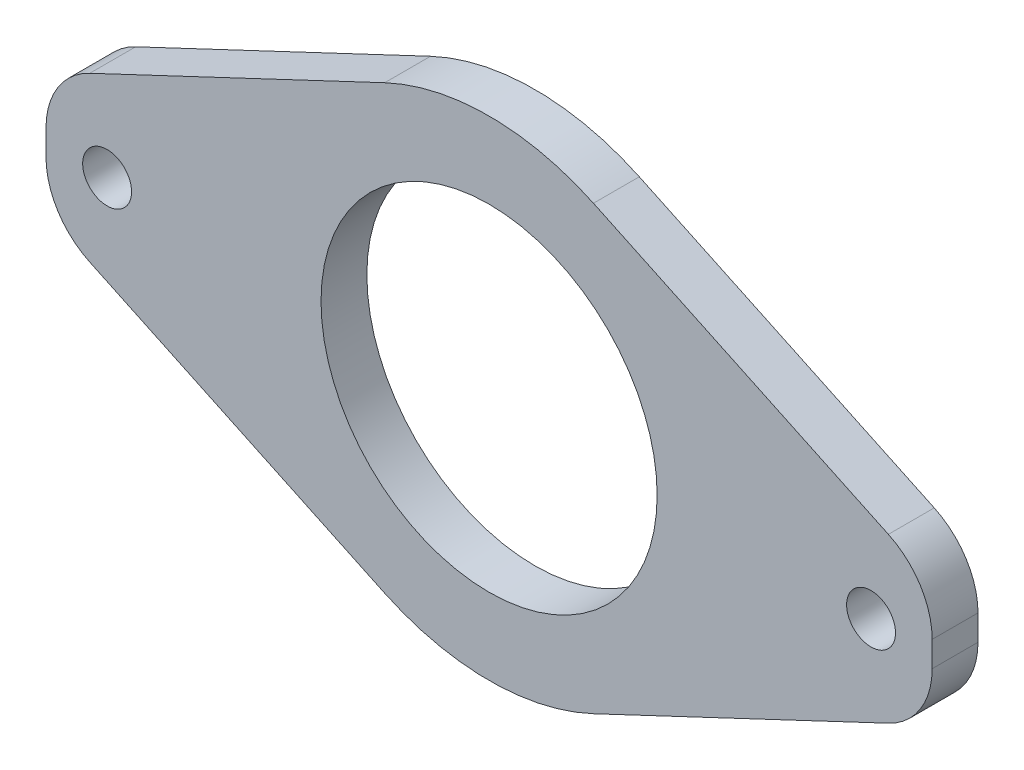
ISO-10303-21;
HEADER;
FILE_DESCRIPTION(('STEP AP214'),'2;1');
FILE_NAME('part.step','',(''),(''),'','','');
FILE_SCHEMA(('AUTOMOTIVE_DESIGN { 1 0 10303 214 1 1 1 1 }'));
ENDSEC;
DATA;
#1=APPLICATION_CONTEXT('core data for automotive mechanical design processes');
#2=APPLICATION_PROTOCOL_DEFINITION('international standard','automotive_design',2000,#1);
#3=PRODUCT_CONTEXT('',#1,'mechanical');
#4=PRODUCT('Part','Part','',(#3));
#5=PRODUCT_RELATED_PRODUCT_CATEGORY('part','',(#4));
#6=PRODUCT_DEFINITION_FORMATION('','',#4);
#7=PRODUCT_DEFINITION_CONTEXT('part definition',#1,'design');
#8=PRODUCT_DEFINITION('design','',#6,#7);
#9=PRODUCT_DEFINITION_SHAPE('','',#8);
#10=(LENGTH_UNIT() NAMED_UNIT(*) SI_UNIT(.MILLI.,.METRE.));
#11=(NAMED_UNIT(*) PLANE_ANGLE_UNIT() SI_UNIT($,.RADIAN.));
#12=(NAMED_UNIT(*) SI_UNIT($,.STERADIAN.) SOLID_ANGLE_UNIT());
#13=UNCERTAINTY_MEASURE_WITH_UNIT(LENGTH_MEASURE(1.E-05),#10,'distance_accuracy_value','');
#14=(GEOMETRIC_REPRESENTATION_CONTEXT(3) GLOBAL_UNCERTAINTY_ASSIGNED_CONTEXT((#13)) GLOBAL_UNIT_ASSIGNED_CONTEXT((#10,
#11,#12)) REPRESENTATION_CONTEXT('',''));
#15=CARTESIAN_POINT('',(0.,0.,0.));
#16=DIRECTION('',(0.,0.,1.));
#17=DIRECTION('',(1.,0.,0.));
#18=AXIS2_PLACEMENT_3D('',#15,#16,#17);
#19=CARTESIAN_POINT('',(0.,0.,3.));
#20=DIRECTION('',(0.,0.,-1.));
#21=DIRECTION('',(-1.,0.,0.));
#22=AXIS2_PLACEMENT_3D('',#19,#20,#21);
#23=CYLINDRICAL_SURFACE('',#22,16.);
#24=CARTESIAN_POINT('',(0.,0.,0.));
#25=DIRECTION('',(0.,0.,1.));
#26=DIRECTION('',(1.,0.,0.));
#27=AXIS2_PLACEMENT_3D('',#24,#25,#26);
#28=CIRCLE('',#27,16.);
#29=CARTESIAN_POINT('',(-6.83199616565601,14.4680277989939,0.));
#30=VERTEX_POINT('',#29);
#31=CARTESIAN_POINT('',(6.83199616565601,14.4680277989939,0.));
#32=VERTEX_POINT('',#31);
#33=EDGE_CURVE('E147',#30,#32,#28,.F.);
#34=ORIENTED_EDGE('',*,*,#33,.F.);
#35=DIRECTION('',(0.,0.,-1.));
#36=VECTOR('',#35,1.);
#37=CARTESIAN_POINT('',(-6.83199616565601,14.4680277989939,3.));
#38=LINE('',#37,#36);
#39=CARTESIAN_POINT('',(-6.83199616565601,14.4680277989939,3.));
#40=VERTEX_POINT('',#39);
#41=EDGE_CURVE('E135',#40,#30,#38,.T.);
#42=ORIENTED_EDGE('',*,*,#41,.F.);
#43=CARTESIAN_POINT('',(0.,0.,3.));
#44=DIRECTION('',(0.,0.,1.));
#45=DIRECTION('',(1.,0.,0.));
#46=AXIS2_PLACEMENT_3D('',#43,#44,#45);
#47=CIRCLE('',#46,16.);
#48=CARTESIAN_POINT('',(6.83199616565601,14.4680277989939,3.));
#49=VERTEX_POINT('',#48);
#50=EDGE_CURVE('E141',#40,#49,#47,.F.);
#51=ORIENTED_EDGE('',*,*,#50,.T.);
#52=DIRECTION('',(0.,0.,-1.));
#53=VECTOR('',#52,1.);
#54=CARTESIAN_POINT('',(6.83199616565601,14.4680277989939,3.));
#55=LINE('',#54,#53);
#56=EDGE_CURVE('E185',#49,#32,#55,.T.);
#57=ORIENTED_EDGE('',*,*,#56,.T.);
#58=EDGE_LOOP('',(#34,#42,#51,#57));
#59=FACE_BOUND('',#58,.T.);
#60=ADVANCED_FACE('F40',(#59),#23,.T.);
#61=CARTESIAN_POINT('',(-6.831996165656,14.4680277989939,3.));
#62=DIRECTION('',(-0.4269997603535,0.904251737437122,0.));
#63=DIRECTION('',(-0.904251737437122,-0.4269997603535,0.));
#64=AXIS2_PLACEMENT_3D('',#61,#62,#63);
#65=PLANE('',#64);
#66=DIRECTION('',(0.904251737437122,0.4269997603535,0.));
#67=VECTOR('',#66,1.);
#68=CARTESIAN_POINT('',(-6.831996165656,14.4680277989939,0.));
#69=LINE('',#68,#67);
#70=CARTESIAN_POINT('',(-26.1349988017675,5.35289187115644,0.));
#71=VERTEX_POINT('',#70);
#72=EDGE_CURVE('E188',#71,#30,#69,.T.);
#73=ORIENTED_EDGE('',*,*,#72,.F.);
#74=DIRECTION('',(0.,0.,-1.));
#75=VECTOR('',#74,1.);
#76=CARTESIAN_POINT('',(-26.1349988017675,5.35289187115644,3.));
#77=LINE('',#76,#75);
#78=CARTESIAN_POINT('',(-26.1349988017675,5.35289187115644,3.));
#79=VERTEX_POINT('',#78);
#80=EDGE_CURVE('E48',#71,#79,#77,.F.);
#81=ORIENTED_EDGE('',*,*,#80,.T.);
#82=DIRECTION('',(0.904251737437122,0.4269997603535,0.));
#83=VECTOR('',#82,1.);
#84=CARTESIAN_POINT('',(-6.831996165656,14.4680277989939,3.));
#85=LINE('',#84,#83);
#86=EDGE_CURVE('E131',#79,#40,#85,.T.);
#87=ORIENTED_EDGE('',*,*,#86,.T.);
#88=ORIENTED_EDGE('',*,*,#41,.T.);
#89=EDGE_LOOP('',(#73,#81,#87,#88));
#90=FACE_BOUND('',#89,.T.);
#91=ADVANCED_FACE('F134',(#90),#65,.T.);
#92=CARTESIAN_POINT('',(-29.,0.,3.));
#93=DIRECTION('',(-1.,0.,0.));
#94=DIRECTION('',(0.,0.,1.));
#95=AXIS2_PLACEMENT_3D('',#92,#93,#94);
#96=PLANE('',#95);
#97=DIRECTION('',(0.,1.,0.));
#98=VECTOR('',#97,1.);
#99=CARTESIAN_POINT('',(-29.,0.,3.));
#100=LINE('',#99,#98);
#101=CARTESIAN_POINT('',(-29.,-0.831633183970835,3.));
#102=VERTEX_POINT('',#101);
#103=CARTESIAN_POINT('',(-29.,0.831633183970836,3.));
#104=VERTEX_POINT('',#103);
#105=EDGE_CURVE('E140',#102,#104,#100,.T.);
#106=ORIENTED_EDGE('',*,*,#105,.T.);
#107=DIRECTION('',(0.,0.,-1.));
#108=VECTOR('',#107,1.);
#109=CARTESIAN_POINT('',(-29.,0.831633183970836,3.));
#110=LINE('',#109,#108);
#111=CARTESIAN_POINT('',(-29.,0.831633183970836,0.));
#112=VERTEX_POINT('',#111);
#113=EDGE_CURVE('E249',#104,#112,#110,.T.);
#114=ORIENTED_EDGE('',*,*,#113,.T.);
#115=DIRECTION('',(0.,1.,0.));
#116=VECTOR('',#115,1.);
#117=CARTESIAN_POINT('',(-29.,0.,0.));
#118=LINE('',#117,#116);
#119=CARTESIAN_POINT('',(-29.,-0.831633183970835,0.));
#120=VERTEX_POINT('',#119);
#121=EDGE_CURVE('E192',#120,#112,#118,.T.);
#122=ORIENTED_EDGE('',*,*,#121,.F.);
#123=DIRECTION('',(0.,0.,-1.));
#124=VECTOR('',#123,1.);
#125=CARTESIAN_POINT('',(-29.,-0.831633183970835,3.));
#126=LINE('',#125,#124);
#127=EDGE_CURVE('E247',#120,#102,#126,.F.);
#128=ORIENTED_EDGE('',*,*,#127,.T.);
#129=EDGE_LOOP('',(#106,#114,#122,#128));
#130=FACE_BOUND('',#129,.T.);
#131=ADVANCED_FACE('F255',(#130),#96,.T.);
#132=CARTESIAN_POINT('',(-6.831996165656,-14.4680277989939,3.));
#133=DIRECTION('',(0.4269997603535,0.904251737437122,0.));
#134=DIRECTION('',(-0.904251737437122,0.4269997603535,0.));
#135=AXIS2_PLACEMENT_3D('',#132,#133,#134);
#136=PLANE('',#135);
#137=DIRECTION('',(0.904251737437122,-0.4269997603535,0.));
#138=VECTOR('',#137,1.);
#139=CARTESIAN_POINT('',(-6.831996165656,-14.4680277989939,3.));
#140=LINE('',#139,#138);
#141=CARTESIAN_POINT('',(-26.1349988017675,-5.35289187115644,3.));
#142=VERTEX_POINT('',#141);
#143=CARTESIAN_POINT('',(-6.83199616565601,-14.4680277989939,3.));
#144=VERTEX_POINT('',#143);
#145=EDGE_CURVE('E165',#142,#144,#140,.T.);
#146=ORIENTED_EDGE('',*,*,#145,.F.);
#147=DIRECTION('',(0.,0.,-1.));
#148=VECTOR('',#147,1.);
#149=CARTESIAN_POINT('',(-26.1349988017675,-5.35289187115644,0.));
#150=LINE('',#149,#148);
#151=CARTESIAN_POINT('',(-26.1349988017675,-5.35289187115644,0.));
#152=VERTEX_POINT('',#151);
#153=EDGE_CURVE('E12',#142,#152,#150,.T.);
#154=ORIENTED_EDGE('',*,*,#153,.T.);
#155=DIRECTION('',(0.904251737437122,-0.4269997603535,0.));
#156=VECTOR('',#155,1.);
#157=CARTESIAN_POINT('',(-6.831996165656,-14.4680277989939,0.));
#158=LINE('',#157,#156);
#159=CARTESIAN_POINT('',(-6.83199616565601,-14.4680277989939,0.));
#160=VERTEX_POINT('',#159);
#161=EDGE_CURVE('E264',#152,#160,#158,.T.);
#162=ORIENTED_EDGE('',*,*,#161,.T.);
#163=DIRECTION('',(0.,0.,-1.));
#164=VECTOR('',#163,1.);
#165=CARTESIAN_POINT('',(-6.83199616565601,-14.4680277989939,3.));
#166=LINE('',#165,#164);
#167=EDGE_CURVE('E149',#144,#160,#166,.T.);
#168=ORIENTED_EDGE('',*,*,#167,.F.);
#169=EDGE_LOOP('',(#146,#154,#162,#168));
#170=FACE_BOUND('',#169,.T.);
#171=ADVANCED_FACE('F294',(#170),#136,.F.);
#172=CARTESIAN_POINT('',(0.,0.,3.));
#173=DIRECTION('',(0.,0.,-1.));
#174=DIRECTION('',(-1.,0.,0.));
#175=AXIS2_PLACEMENT_3D('',#172,#173,#174);
#176=CYLINDRICAL_SURFACE('',#175,16.);
#177=CARTESIAN_POINT('',(0.,0.,0.));
#178=DIRECTION('',(0.,0.,1.));
#179=DIRECTION('',(1.,0.,0.));
#180=AXIS2_PLACEMENT_3D('',#177,#178,#179);
#181=CIRCLE('',#180,16.);
#182=CARTESIAN_POINT('',(6.83199616565601,-14.4680277989939,0.));
#183=VERTEX_POINT('',#182);
#184=EDGE_CURVE('E266',#160,#183,#181,.T.);
#185=ORIENTED_EDGE('',*,*,#184,.T.);
#186=DIRECTION('',(0.,0.,-1.));
#187=VECTOR('',#186,1.);
#188=CARTESIAN_POINT('',(6.83199616565601,-14.4680277989939,3.));
#189=LINE('',#188,#187);
#190=CARTESIAN_POINT('',(6.83199616565601,-14.4680277989939,3.));
#191=VERTEX_POINT('',#190);
#192=EDGE_CURVE('E215',#191,#183,#189,.T.);
#193=ORIENTED_EDGE('',*,*,#192,.F.);
#194=CARTESIAN_POINT('',(0.,0.,3.));
#195=DIRECTION('',(0.,0.,1.));
#196=DIRECTION('',(1.,0.,0.));
#197=AXIS2_PLACEMENT_3D('',#194,#195,#196);
#198=CIRCLE('',#197,16.);
#199=EDGE_CURVE('E167',#144,#191,#198,.T.);
#200=ORIENTED_EDGE('',*,*,#199,.F.);
#201=ORIENTED_EDGE('',*,*,#167,.T.);
#202=EDGE_LOOP('',(#185,#193,#200,#201));
#203=FACE_BOUND('',#202,.T.);
#204=ADVANCED_FACE('F298',(#203),#176,.T.);
#205=CARTESIAN_POINT('',(6.831996165656,-14.4680277989939,3.));
#206=DIRECTION('',(0.4269997603535,-0.904251737437122,0.));
#207=DIRECTION('',(0.904251737437122,0.4269997603535,0.));
#208=AXIS2_PLACEMENT_3D('',#205,#206,#207);
#209=PLANE('',#208);
#210=DIRECTION('',(-0.904251737437122,-0.4269997603535,0.));
#211=VECTOR('',#210,1.);
#212=CARTESIAN_POINT('',(6.831996165656,-14.4680277989939,0.));
#213=LINE('',#212,#211);
#214=CARTESIAN_POINT('',(26.1349988017675,-5.35289187115644,0.));
#215=VERTEX_POINT('',#214);
#216=EDGE_CURVE('E271',#215,#183,#213,.T.);
#217=ORIENTED_EDGE('',*,*,#216,.F.);
#218=DIRECTION('',(0.,0.,-1.));
#219=VECTOR('',#218,1.);
#220=CARTESIAN_POINT('',(26.1349988017675,-5.35289187115644,3.));
#221=LINE('',#220,#219);
#222=CARTESIAN_POINT('',(26.1349988017675,-5.35289187115644,3.));
#223=VERTEX_POINT('',#222);
#224=EDGE_CURVE('E55',#215,#223,#221,.F.);
#225=ORIENTED_EDGE('',*,*,#224,.T.);
#226=DIRECTION('',(-0.904251737437122,-0.4269997603535,0.));
#227=VECTOR('',#226,1.);
#228=CARTESIAN_POINT('',(6.831996165656,-14.4680277989939,3.));
#229=LINE('',#228,#227);
#230=EDGE_CURVE('E170',#223,#191,#229,.T.);
#231=ORIENTED_EDGE('',*,*,#230,.T.);
#232=ORIENTED_EDGE('',*,*,#192,.T.);
#233=EDGE_LOOP('',(#217,#225,#231,#232));
#234=FACE_BOUND('',#233,.T.);
#235=ADVANCED_FACE('F331',(#234),#209,.T.);
#236=CARTESIAN_POINT('',(29.,0.,3.));
#237=DIRECTION('',(1.,0.,0.));
#238=DIRECTION('',(0.,0.,-1.));
#239=AXIS2_PLACEMENT_3D('',#236,#237,#238);
#240=PLANE('',#239);
#241=DIRECTION('',(0.,-1.,0.));
#242=VECTOR('',#241,1.);
#243=CARTESIAN_POINT('',(29.,0.,0.));
#244=LINE('',#243,#242);
#245=CARTESIAN_POINT('',(29.,0.831633183970835,0.));
#246=VERTEX_POINT('',#245);
#247=CARTESIAN_POINT('',(29.,-0.831633183970836,0.));
#248=VERTEX_POINT('',#247);
#249=EDGE_CURVE('E282',#246,#248,#244,.T.);
#250=ORIENTED_EDGE('',*,*,#249,.F.);
#251=DIRECTION('',(0.,0.,-1.));
#252=VECTOR('',#251,1.);
#253=CARTESIAN_POINT('',(29.,0.831633183970835,3.));
#254=LINE('',#253,#252);
#255=CARTESIAN_POINT('',(29.,0.831633183970835,3.));
#256=VERTEX_POINT('',#255);
#257=EDGE_CURVE('E237',#246,#256,#254,.F.);
#258=ORIENTED_EDGE('',*,*,#257,.T.);
#259=DIRECTION('',(0.,-1.,0.));
#260=VECTOR('',#259,1.);
#261=CARTESIAN_POINT('',(29.,0.,3.));
#262=LINE('',#261,#260);
#263=CARTESIAN_POINT('',(29.,-0.831633183970836,3.));
#264=VERTEX_POINT('',#263);
#265=EDGE_CURVE('E172',#256,#264,#262,.T.);
#266=ORIENTED_EDGE('',*,*,#265,.T.);
#267=DIRECTION('',(0.,0.,-1.));
#268=VECTOR('',#267,1.);
#269=CARTESIAN_POINT('',(29.,-0.831633183970836,3.));
#270=LINE('',#269,#268);
#271=EDGE_CURVE('E234',#264,#248,#270,.T.);
#272=ORIENTED_EDGE('',*,*,#271,.T.);
#273=EDGE_LOOP('',(#250,#258,#266,#272));
#274=FACE_BOUND('',#273,.T.);
#275=ADVANCED_FACE('F305',(#274),#240,.T.);
#276=CARTESIAN_POINT('',(-25.,0.,3.));
#277=DIRECTION('',(0.,0.,-1.));
#278=DIRECTION('',(-1.,0.,0.));
#279=AXIS2_PLACEMENT_3D('',#276,#277,#278);
#280=CYLINDRICAL_SURFACE('',#279,1.6);
#281=CARTESIAN_POINT('',(-25.,0.,3.));
#282=DIRECTION('',(0.,0.,1.));
#283=DIRECTION('',(1.,0.,0.));
#284=AXIS2_PLACEMENT_3D('',#281,#282,#283);
#285=CIRCLE('',#284,1.6);
#286=CARTESIAN_POINT('',(-23.4,0.,3.));
#287=VERTEX_POINT('',#286);
#288=EDGE_CURVE('E179',#287,#287,#285,.T.);
#289=ORIENTED_EDGE('',*,*,#288,.T.);
#290=EDGE_LOOP('',(#289));
#291=FACE_BOUND('',#290,.T.);
#292=CARTESIAN_POINT('',(-25.,0.,0.));
#293=DIRECTION('',(0.,0.,1.));
#294=DIRECTION('',(1.,0.,0.));
#295=AXIS2_PLACEMENT_3D('',#292,#293,#294);
#296=CIRCLE('',#295,1.6);
#297=CARTESIAN_POINT('',(-23.4,0.,0.));
#298=VERTEX_POINT('',#297);
#299=EDGE_CURVE('E161',#298,#298,#296,.T.);
#300=ORIENTED_EDGE('',*,*,#299,.F.);
#301=EDGE_LOOP('',(#300));
#302=FACE_BOUND('',#301,.T.);
#303=ADVANCED_FACE('F336',(#291,#302),#280,.F.);
#304=CARTESIAN_POINT('',(0.,0.,3.));
#305=DIRECTION('',(0.,0.,-1.));
#306=DIRECTION('',(-1.,0.,0.));
#307=AXIS2_PLACEMENT_3D('',#304,#305,#306);
#308=CYLINDRICAL_SURFACE('',#307,11.);
#309=CARTESIAN_POINT('',(0.,0.,3.));
#310=DIRECTION('',(0.,0.,1.));
#311=DIRECTION('',(1.,0.,0.));
#312=AXIS2_PLACEMENT_3D('',#309,#310,#311);
#313=CIRCLE('',#312,11.);
#314=CARTESIAN_POINT('',(11.,0.,3.));
#315=VERTEX_POINT('',#314);
#316=EDGE_CURVE('E176',#315,#315,#313,.T.);
#317=ORIENTED_EDGE('',*,*,#316,.T.);
#318=EDGE_LOOP('',(#317));
#319=FACE_BOUND('',#318,.T.);
#320=CARTESIAN_POINT('',(0.,0.,0.));
#321=DIRECTION('',(0.,0.,1.));
#322=DIRECTION('',(1.,0.,0.));
#323=AXIS2_PLACEMENT_3D('',#320,#321,#322);
#324=CIRCLE('',#323,11.);
#325=CARTESIAN_POINT('',(11.,0.,0.));
#326=VERTEX_POINT('',#325);
#327=EDGE_CURVE('E201',#326,#326,#324,.T.);
#328=ORIENTED_EDGE('',*,*,#327,.F.);
#329=EDGE_LOOP('',(#328));
#330=FACE_BOUND('',#329,.T.);
#331=ADVANCED_FACE('F340',(#319,#330),#308,.F.);
#332=CARTESIAN_POINT('',(6.831996165656,14.4680277989939,3.));
#333=DIRECTION('',(-0.4269997603535,-0.904251737437122,0.));
#334=DIRECTION('',(0.904251737437122,-0.4269997603535,0.));
#335=AXIS2_PLACEMENT_3D('',#332,#333,#334);
#336=PLANE('',#335);
#337=DIRECTION('',(-0.904251737437122,0.4269997603535,0.));
#338=VECTOR('',#337,1.);
#339=CARTESIAN_POINT('',(6.831996165656,14.4680277989939,3.));
#340=LINE('',#339,#338);
#341=CARTESIAN_POINT('',(26.1349988017675,5.35289187115644,3.));
#342=VERTEX_POINT('',#341);
#343=EDGE_CURVE('E155',#342,#49,#340,.T.);
#344=ORIENTED_EDGE('',*,*,#343,.F.);
#345=DIRECTION('',(0.,0.,-1.));
#346=VECTOR('',#345,1.);
#347=CARTESIAN_POINT('',(26.1349988017675,5.35289187115644,0.));
#348=LINE('',#347,#346);
#349=CARTESIAN_POINT('',(26.1349988017675,5.35289187115644,0.));
#350=VERTEX_POINT('',#349);
#351=EDGE_CURVE('E148',#342,#350,#348,.T.);
#352=ORIENTED_EDGE('',*,*,#351,.T.);
#353=DIRECTION('',(-0.904251737437122,0.4269997603535,0.));
#354=VECTOR('',#353,1.);
#355=CARTESIAN_POINT('',(6.831996165656,14.4680277989939,0.));
#356=LINE('',#355,#354);
#357=EDGE_CURVE('E206',#350,#32,#356,.T.);
#358=ORIENTED_EDGE('',*,*,#357,.T.);
#359=ORIENTED_EDGE('',*,*,#56,.F.);
#360=EDGE_LOOP('',(#344,#352,#358,#359));
#361=FACE_BOUND('',#360,.T.);
#362=ADVANCED_FACE('F289',(#361),#336,.F.);
#363=CARTESIAN_POINT('',(25.,0.,3.));
#364=DIRECTION('',(0.,0.,-1.));
#365=DIRECTION('',(-1.,0.,0.));
#366=AXIS2_PLACEMENT_3D('',#363,#364,#365);
#367=CYLINDRICAL_SURFACE('',#366,1.6);
#368=CARTESIAN_POINT('',(25.,0.,3.));
#369=DIRECTION('',(0.,0.,1.));
#370=DIRECTION('',(1.,0.,0.));
#371=AXIS2_PLACEMENT_3D('',#368,#369,#370);
#372=CIRCLE('',#371,1.6);
#373=CARTESIAN_POINT('',(26.6,0.,3.));
#374=VERTEX_POINT('',#373);
#375=EDGE_CURVE('E182',#374,#374,#372,.T.);
#376=ORIENTED_EDGE('',*,*,#375,.T.);
#377=EDGE_LOOP('',(#376));
#378=FACE_BOUND('',#377,.T.);
#379=CARTESIAN_POINT('',(25.,0.,0.));
#380=DIRECTION('',(0.,0.,1.));
#381=DIRECTION('',(1.,0.,0.));
#382=AXIS2_PLACEMENT_3D('',#379,#380,#381);
#383=CIRCLE('',#382,1.6);
#384=CARTESIAN_POINT('',(26.6,0.,0.));
#385=VERTEX_POINT('',#384);
#386=EDGE_CURVE('E157',#385,#385,#383,.T.);
#387=ORIENTED_EDGE('',*,*,#386,.F.);
#388=EDGE_LOOP('',(#387));
#389=FACE_BOUND('',#388,.T.);
#390=ADVANCED_FACE('F339',(#378,#389),#367,.F.);
#391=CARTESIAN_POINT('',(0.,0.,3.));
#392=DIRECTION('',(0.,0.,1.));
#393=DIRECTION('',(1.,0.,0.));
#394=AXIS2_PLACEMENT_3D('',#391,#392,#393);
#395=PLANE('',#394);
#396=ORIENTED_EDGE('',*,*,#265,.F.);
#397=CARTESIAN_POINT('',(24.,0.831633183970835,3.));
#398=DIRECTION('',(0.,0.,1.));
#399=DIRECTION('',(1.,0.,0.));
#400=AXIS2_PLACEMENT_3D('',#397,#398,#399);
#401=CIRCLE('',#400,5.);
#402=EDGE_CURVE('E244',#256,#342,#401,.T.);
#403=ORIENTED_EDGE('',*,*,#402,.T.);
#404=ORIENTED_EDGE('',*,*,#343,.T.);
#405=ORIENTED_EDGE('',*,*,#50,.F.);
#406=ORIENTED_EDGE('',*,*,#86,.F.);
#407=CARTESIAN_POINT('',(-24.,0.831633183970836,3.));
#408=DIRECTION('',(0.,0.,1.));
#409=DIRECTION('',(1.,0.,0.));
#410=AXIS2_PLACEMENT_3D('',#407,#408,#409);
#411=CIRCLE('',#410,5.);
#412=EDGE_CURVE('E240',#79,#104,#411,.T.);
#413=ORIENTED_EDGE('',*,*,#412,.T.);
#414=ORIENTED_EDGE('',*,*,#105,.F.);
#415=CARTESIAN_POINT('',(-24.,-0.831633183970835,3.));
#416=DIRECTION('',(0.,0.,1.));
#417=DIRECTION('',(1.,0.,0.));
#418=AXIS2_PLACEMENT_3D('',#415,#416,#417);
#419=CIRCLE('',#418,5.);
#420=EDGE_CURVE('E63',#102,#142,#419,.T.);
#421=ORIENTED_EDGE('',*,*,#420,.T.);
#422=ORIENTED_EDGE('',*,*,#145,.T.);
#423=ORIENTED_EDGE('',*,*,#199,.T.);
#424=ORIENTED_EDGE('',*,*,#230,.F.);
#425=CARTESIAN_POINT('',(24.,-0.831633183970836,3.));
#426=DIRECTION('',(0.,0.,1.));
#427=DIRECTION('',(1.,0.,0.));
#428=AXIS2_PLACEMENT_3D('',#425,#426,#427);
#429=CIRCLE('',#428,5.);
#430=EDGE_CURVE('E242',#223,#264,#429,.T.);
#431=ORIENTED_EDGE('',*,*,#430,.T.);
#432=EDGE_LOOP('',(#396,#403,#404,#405,#406,#413,#414,#421,#422,#423,#424,#431));
#433=FACE_BOUND('',#432,.T.);
#434=ORIENTED_EDGE('',*,*,#316,.F.);
#435=EDGE_LOOP('',(#434));
#436=FACE_BOUND('',#435,.T.);
#437=ORIENTED_EDGE('',*,*,#288,.F.);
#438=EDGE_LOOP('',(#437));
#439=FACE_BOUND('',#438,.T.);
#440=ORIENTED_EDGE('',*,*,#375,.F.);
#441=EDGE_LOOP('',(#440));
#442=FACE_BOUND('',#441,.T.);
#443=ADVANCED_FACE('F152',(#433,#436,#439,#442),#395,.T.);
#444=CARTESIAN_POINT('',(0.,0.,0.));
#445=DIRECTION('',(0.,0.,1.));
#446=DIRECTION('',(1.,0.,0.));
#447=AXIS2_PLACEMENT_3D('',#444,#445,#446);
#448=PLANE('',#447);
#449=ORIENTED_EDGE('',*,*,#357,.F.);
#450=CARTESIAN_POINT('',(24.,0.831633183970835,0.));
#451=DIRECTION('',(0.,0.,1.));
#452=DIRECTION('',(1.,0.,0.));
#453=AXIS2_PLACEMENT_3D('',#450,#451,#452);
#454=CIRCLE('',#453,5.);
#455=EDGE_CURVE('E231',#350,#246,#454,.F.);
#456=ORIENTED_EDGE('',*,*,#455,.T.);
#457=ORIENTED_EDGE('',*,*,#249,.T.);
#458=CARTESIAN_POINT('',(24.,-0.831633183970836,0.));
#459=DIRECTION('',(0.,0.,1.));
#460=DIRECTION('',(1.,0.,0.));
#461=AXIS2_PLACEMENT_3D('',#458,#459,#460);
#462=CIRCLE('',#461,5.);
#463=EDGE_CURVE('E228',#248,#215,#462,.F.);
#464=ORIENTED_EDGE('',*,*,#463,.T.);
#465=ORIENTED_EDGE('',*,*,#216,.T.);
#466=ORIENTED_EDGE('',*,*,#184,.F.);
#467=ORIENTED_EDGE('',*,*,#161,.F.);
#468=CARTESIAN_POINT('',(-24.,-0.831633183970835,0.));
#469=DIRECTION('',(0.,0.,1.));
#470=DIRECTION('',(1.,0.,0.));
#471=AXIS2_PLACEMENT_3D('',#468,#469,#470);
#472=CIRCLE('',#471,5.);
#473=EDGE_CURVE('E222',#152,#120,#472,.F.);
#474=ORIENTED_EDGE('',*,*,#473,.T.);
#475=ORIENTED_EDGE('',*,*,#121,.T.);
#476=CARTESIAN_POINT('',(-24.,0.831633183970836,0.));
#477=DIRECTION('',(0.,0.,1.));
#478=DIRECTION('',(1.,0.,0.));
#479=AXIS2_PLACEMENT_3D('',#476,#477,#478);
#480=CIRCLE('',#479,5.);
#481=EDGE_CURVE('E225',#112,#71,#480,.F.);
#482=ORIENTED_EDGE('',*,*,#481,.T.);
#483=ORIENTED_EDGE('',*,*,#72,.T.);
#484=ORIENTED_EDGE('',*,*,#33,.T.);
#485=EDGE_LOOP('',(#449,#456,#457,#464,#465,#466,#467,#474,#475,#482,#483,#484));
#486=FACE_BOUND('',#485,.T.);
#487=ORIENTED_EDGE('',*,*,#327,.T.);
#488=EDGE_LOOP('',(#487));
#489=FACE_BOUND('',#488,.T.);
#490=ORIENTED_EDGE('',*,*,#299,.T.);
#491=EDGE_LOOP('',(#490));
#492=FACE_BOUND('',#491,.T.);
#493=ORIENTED_EDGE('',*,*,#386,.T.);
#494=EDGE_LOOP('',(#493));
#495=FACE_BOUND('',#494,.T.);
#496=ADVANCED_FACE('F260',(#486,#489,#492,#495),#448,.F.);
#497=CARTESIAN_POINT('',(24.,0.831633183970835,3.));
#498=DIRECTION('',(0.,0.,1.));
#499=DIRECTION('',(1.,0.,0.));
#500=AXIS2_PLACEMENT_3D('',#497,#498,#499);
#501=CYLINDRICAL_SURFACE('',#500,5.);
#502=ORIENTED_EDGE('',*,*,#402,.F.);
#503=ORIENTED_EDGE('',*,*,#257,.F.);
#504=ORIENTED_EDGE('',*,*,#455,.F.);
#505=ORIENTED_EDGE('',*,*,#351,.F.);
#506=EDGE_LOOP('',(#502,#503,#504,#505));
#507=FACE_BOUND('',#506,.T.);
#508=ADVANCED_FACE('F309',(#507),#501,.T.);
#509=CARTESIAN_POINT('',(24.,-0.831633183970836,3.));
#510=DIRECTION('',(0.,0.,-1.));
#511=DIRECTION('',(-1.,0.,0.));
#512=AXIS2_PLACEMENT_3D('',#509,#510,#511);
#513=CYLINDRICAL_SURFACE('',#512,5.);
#514=ORIENTED_EDGE('',*,*,#430,.F.);
#515=ORIENTED_EDGE('',*,*,#224,.F.);
#516=ORIENTED_EDGE('',*,*,#463,.F.);
#517=ORIENTED_EDGE('',*,*,#271,.F.);
#518=EDGE_LOOP('',(#514,#515,#516,#517));
#519=FACE_BOUND('',#518,.T.);
#520=ADVANCED_FACE('F303',(#519),#513,.T.);
#521=CARTESIAN_POINT('',(-24.,0.831633183970836,3.));
#522=DIRECTION('',(0.,0.,-1.));
#523=DIRECTION('',(-1.,0.,0.));
#524=AXIS2_PLACEMENT_3D('',#521,#522,#523);
#525=CYLINDRICAL_SURFACE('',#524,5.);
#526=ORIENTED_EDGE('',*,*,#412,.F.);
#527=ORIENTED_EDGE('',*,*,#80,.F.);
#528=ORIENTED_EDGE('',*,*,#481,.F.);
#529=ORIENTED_EDGE('',*,*,#113,.F.);
#530=EDGE_LOOP('',(#526,#527,#528,#529));
#531=FACE_BOUND('',#530,.T.);
#532=ADVANCED_FACE('F291',(#531),#525,.T.);
#533=CARTESIAN_POINT('',(-24.,-0.831633183970835,3.));
#534=DIRECTION('',(0.,0.,1.));
#535=DIRECTION('',(1.,0.,0.));
#536=AXIS2_PLACEMENT_3D('',#533,#534,#535);
#537=CYLINDRICAL_SURFACE('',#536,5.);
#538=ORIENTED_EDGE('',*,*,#420,.F.);
#539=ORIENTED_EDGE('',*,*,#127,.F.);
#540=ORIENTED_EDGE('',*,*,#473,.F.);
#541=ORIENTED_EDGE('',*,*,#153,.F.);
#542=EDGE_LOOP('',(#538,#539,#540,#541));
#543=FACE_BOUND('',#542,.T.);
#544=ADVANCED_FACE('F42',(#543),#537,.T.);
#545=CLOSED_SHELL('',(#60,#91,#131,#171,#204,#235,#275,#303,#331,#362,#390,#443,#496,#508,#520,
#532,#544));
#546=MANIFOLD_SOLID_BREP('B2',#545);
#547=ADVANCED_BREP_SHAPE_REPRESENTATION('',(#18,#546),#14);
#548=SHAPE_DEFINITION_REPRESENTATION(#9,#547);
ENDSEC;
END-ISO-10303-21;
